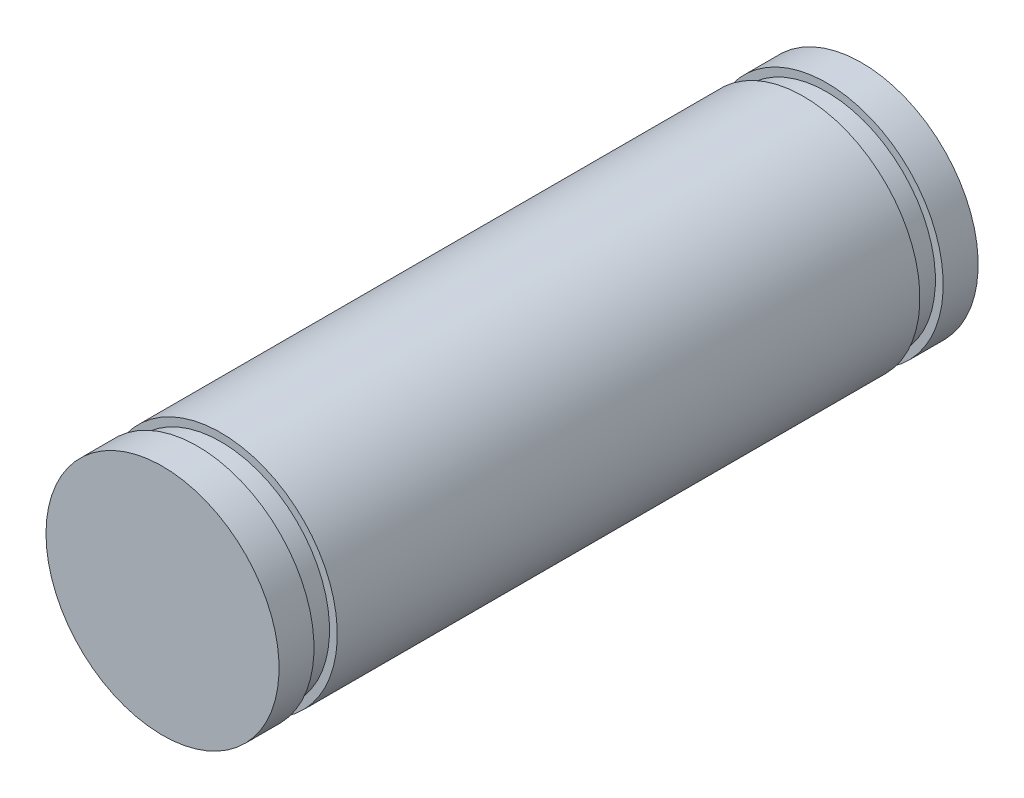
ISO-10303-21;
HEADER;
FILE_DESCRIPTION(('STEP AP214'),'2;1');
FILE_NAME('part.step','',(''),(''),'','','');
FILE_SCHEMA(('AUTOMOTIVE_DESIGN { 1 0 10303 214 1 1 1 1 }'));
ENDSEC;
DATA;
#1=APPLICATION_CONTEXT('core data for automotive mechanical design processes');
#2=APPLICATION_PROTOCOL_DEFINITION('international standard','automotive_design',2000,#1);
#3=PRODUCT_CONTEXT('',#1,'mechanical');
#4=PRODUCT('Part','Part','',(#3));
#5=PRODUCT_RELATED_PRODUCT_CATEGORY('part','',(#4));
#6=PRODUCT_DEFINITION_FORMATION('','',#4);
#7=PRODUCT_DEFINITION_CONTEXT('part definition',#1,'design');
#8=PRODUCT_DEFINITION('design','',#6,#7);
#9=PRODUCT_DEFINITION_SHAPE('','',#8);
#10=(LENGTH_UNIT() NAMED_UNIT(*) SI_UNIT(.MILLI.,.METRE.));
#11=(NAMED_UNIT(*) PLANE_ANGLE_UNIT() SI_UNIT($,.RADIAN.));
#12=(NAMED_UNIT(*) SI_UNIT($,.STERADIAN.) SOLID_ANGLE_UNIT());
#13=UNCERTAINTY_MEASURE_WITH_UNIT(LENGTH_MEASURE(1.E-05),#10,'distance_accuracy_value','');
#14=(GEOMETRIC_REPRESENTATION_CONTEXT(3) GLOBAL_UNCERTAINTY_ASSIGNED_CONTEXT((#13)) GLOBAL_UNIT_ASSIGNED_CONTEXT((#10,
#11,#12)) REPRESENTATION_CONTEXT('',''));
#15=CARTESIAN_POINT('',(0.,0.,0.));
#16=DIRECTION('',(0.,0.,1.));
#17=DIRECTION('',(1.,0.,0.));
#18=AXIS2_PLACEMENT_3D('',#15,#16,#17);
#19=CARTESIAN_POINT('',(0.,0.,18.));
#20=DIRECTION('',(0.,0.,1.));
#21=DIRECTION('',(1.,0.,0.));
#22=AXIS2_PLACEMENT_3D('',#19,#20,#21);
#23=PLANE('',#22);
#24=CARTESIAN_POINT('',(0.,0.,18.));
#25=DIRECTION('',(0.,0.,-1.));
#26=DIRECTION('',(-1.,0.,0.));
#27=AXIS2_PLACEMENT_3D('',#24,#25,#26);
#28=CIRCLE('',#27,3.);
#29=CARTESIAN_POINT('',(-3.,0.,18.));
#30=VERTEX_POINT('',#29);
#31=EDGE_CURVE('E18',#30,#30,#28,.T.);
#32=ORIENTED_EDGE('',*,*,#31,.F.);
#33=EDGE_LOOP('',(#32));
#34=FACE_BOUND('',#33,.T.);
#35=ADVANCED_FACE('F15',(#34),#23,.T.);
#36=CARTESIAN_POINT('',(0.,0.,0.));
#37=DIRECTION('',(0.,0.,1.));
#38=DIRECTION('',(1.,0.,0.));
#39=AXIS2_PLACEMENT_3D('',#36,#37,#38);
#40=PLANE('',#39);
#41=CARTESIAN_POINT('',(0.,0.,0.));
#42=DIRECTION('',(0.,0.,-1.));
#43=DIRECTION('',(-1.,0.,0.));
#44=AXIS2_PLACEMENT_3D('',#41,#42,#43);
#45=CIRCLE('',#44,3.);
#46=CARTESIAN_POINT('',(-3.,0.,0.));
#47=VERTEX_POINT('',#46);
#48=EDGE_CURVE('E46',#47,#47,#45,.F.);
#49=ORIENTED_EDGE('',*,*,#48,.F.);
#50=EDGE_LOOP('',(#49));
#51=FACE_BOUND('',#50,.T.);
#52=ADVANCED_FACE('F57',(#51),#40,.F.);
#53=CARTESIAN_POINT('',(0.,0.,18.));
#54=DIRECTION('',(0.,0.,-1.));
#55=DIRECTION('',(-1.,0.,0.));
#56=AXIS2_PLACEMENT_3D('',#53,#54,#55);
#57=CYLINDRICAL_SURFACE('',#56,3.);
#58=ORIENTED_EDGE('',*,*,#31,.T.);
#59=EDGE_LOOP('',(#58));
#60=FACE_BOUND('',#59,.T.);
#61=CARTESIAN_POINT('',(0.,0.,17.1));
#62=DIRECTION('',(0.,0.,-1.));
#63=DIRECTION('',(-1.,0.,0.));
#64=AXIS2_PLACEMENT_3D('',#61,#62,#63);
#65=CIRCLE('',#64,3.);
#66=CARTESIAN_POINT('',(-3.,0.,17.1));
#67=VERTEX_POINT('',#66);
#68=EDGE_CURVE('E44',#67,#67,#65,.T.);
#69=ORIENTED_EDGE('',*,*,#68,.F.);
#70=EDGE_LOOP('',(#69));
#71=FACE_BOUND('',#70,.T.);
#72=ADVANCED_FACE('F53',(#60,#71),#57,.T.);
#73=CARTESIAN_POINT('',(0.,0.,18.));
#74=DIRECTION('',(0.,0.,-1.));
#75=DIRECTION('',(-1.,0.,0.));
#76=AXIS2_PLACEMENT_3D('',#73,#74,#75);
#77=CYLINDRICAL_SURFACE('',#76,3.);
#78=CARTESIAN_POINT('',(0.,0.,0.900000000000001));
#79=DIRECTION('',(0.,0.,-1.));
#80=DIRECTION('',(-1.,0.,0.));
#81=AXIS2_PLACEMENT_3D('',#78,#79,#80);
#82=CIRCLE('',#81,3.);
#83=CARTESIAN_POINT('',(-3.,0.,0.900000000000001));
#84=VERTEX_POINT('',#83);
#85=EDGE_CURVE('E41',#84,#84,#82,.F.);
#86=ORIENTED_EDGE('',*,*,#85,.F.);
#87=EDGE_LOOP('',(#86));
#88=FACE_BOUND('',#87,.T.);
#89=ORIENTED_EDGE('',*,*,#48,.T.);
#90=EDGE_LOOP('',(#89));
#91=FACE_BOUND('',#90,.T.);
#92=ADVANCED_FACE('F93',(#88,#91),#77,.T.);
#93=CARTESIAN_POINT('',(3.,0.,17.1));
#94=DIRECTION('',(0.,0.,-1.));
#95=DIRECTION('',(-1.,0.,0.));
#96=AXIS2_PLACEMENT_3D('',#93,#94,#95);
#97=PLANE('',#96);
#98=CARTESIAN_POINT('',(0.,0.,17.1));
#99=DIRECTION('',(0.,0.,-1.));
#100=DIRECTION('',(-1.,0.,0.));
#101=AXIS2_PLACEMENT_3D('',#98,#99,#100);
#102=CIRCLE('',#101,2.8);
#103=CARTESIAN_POINT('',(-2.8,0.,17.1));
#104=VERTEX_POINT('',#103);
#105=EDGE_CURVE('E38',#104,#104,#102,.T.);
#106=ORIENTED_EDGE('',*,*,#105,.F.);
#107=EDGE_LOOP('',(#106));
#108=FACE_BOUND('',#107,.T.);
#109=ORIENTED_EDGE('',*,*,#68,.T.);
#110=EDGE_LOOP('',(#109));
#111=FACE_BOUND('',#110,.T.);
#112=ADVANCED_FACE('F89',(#108,#111),#97,.T.);
#113=CARTESIAN_POINT('',(3.,0.,0.9));
#114=DIRECTION('',(0.,0.,1.));
#115=DIRECTION('',(1.,0.,0.));
#116=AXIS2_PLACEMENT_3D('',#113,#114,#115);
#117=PLANE('',#116);
#118=ORIENTED_EDGE('',*,*,#85,.T.);
#119=EDGE_LOOP('',(#118));
#120=FACE_BOUND('',#119,.T.);
#121=CARTESIAN_POINT('',(0.,0.,0.9));
#122=DIRECTION('',(0.,0.,-1.));
#123=DIRECTION('',(-1.,0.,0.));
#124=AXIS2_PLACEMENT_3D('',#121,#122,#123);
#125=CIRCLE('',#124,2.8);
#126=CARTESIAN_POINT('',(-2.8,0.,0.9));
#127=VERTEX_POINT('',#126);
#128=EDGE_CURVE('E35',#127,#127,#125,.F.);
#129=ORIENTED_EDGE('',*,*,#128,.F.);
#130=EDGE_LOOP('',(#129));
#131=FACE_BOUND('',#130,.T.);
#132=ADVANCED_FACE('F85',(#120,#131),#117,.T.);
#133=CARTESIAN_POINT('',(0.,0.,0.));
#134=DIRECTION('',(0.,0.,-1.));
#135=DIRECTION('',(-1.,0.,0.));
#136=AXIS2_PLACEMENT_3D('',#133,#134,#135);
#137=CYLINDRICAL_SURFACE('',#136,2.8);
#138=ORIENTED_EDGE('',*,*,#105,.T.);
#139=EDGE_LOOP('',(#138));
#140=FACE_BOUND('',#139,.T.);
#141=CARTESIAN_POINT('',(0.,0.,16.5));
#142=DIRECTION('',(0.,0.,-1.));
#143=DIRECTION('',(-1.,0.,0.));
#144=AXIS2_PLACEMENT_3D('',#141,#142,#143);
#145=CIRCLE('',#144,2.8);
#146=CARTESIAN_POINT('',(-2.8,0.,16.5));
#147=VERTEX_POINT('',#146);
#148=EDGE_CURVE('E32',#147,#147,#145,.T.);
#149=ORIENTED_EDGE('',*,*,#148,.F.);
#150=EDGE_LOOP('',(#149));
#151=FACE_BOUND('',#150,.T.);
#152=ADVANCED_FACE('F81',(#140,#151),#137,.T.);
#153=CARTESIAN_POINT('',(0.,0.,0.));
#154=DIRECTION('',(0.,0.,-1.));
#155=DIRECTION('',(-1.,0.,0.));
#156=AXIS2_PLACEMENT_3D('',#153,#154,#155);
#157=CYLINDRICAL_SURFACE('',#156,2.8);
#158=CARTESIAN_POINT('',(0.,0.,1.5));
#159=DIRECTION('',(0.,0.,-1.));
#160=DIRECTION('',(-1.,0.,0.));
#161=AXIS2_PLACEMENT_3D('',#158,#159,#160);
#162=CIRCLE('',#161,2.8);
#163=CARTESIAN_POINT('',(-2.8,0.,1.5));
#164=VERTEX_POINT('',#163);
#165=EDGE_CURVE('E27',#164,#164,#162,.F.);
#166=ORIENTED_EDGE('',*,*,#165,.F.);
#167=EDGE_LOOP('',(#166));
#168=FACE_BOUND('',#167,.T.);
#169=ORIENTED_EDGE('',*,*,#128,.T.);
#170=EDGE_LOOP('',(#169));
#171=FACE_BOUND('',#170,.T.);
#172=ADVANCED_FACE('F77',(#168,#171),#157,.T.);
#173=CARTESIAN_POINT('',(3.,0.,16.5));
#174=DIRECTION('',(0.,0.,1.));
#175=DIRECTION('',(1.,0.,0.));
#176=AXIS2_PLACEMENT_3D('',#173,#174,#175);
#177=PLANE('',#176);
#178=CARTESIAN_POINT('',(0.,0.,16.5));
#179=DIRECTION('',(0.,0.,-1.));
#180=DIRECTION('',(-1.,0.,0.));
#181=AXIS2_PLACEMENT_3D('',#178,#179,#180);
#182=CIRCLE('',#181,3.);
#183=CARTESIAN_POINT('',(-3.,0.,16.5));
#184=VERTEX_POINT('',#183);
#185=EDGE_CURVE('E22',#184,#184,#182,.T.);
#186=ORIENTED_EDGE('',*,*,#185,.F.);
#187=EDGE_LOOP('',(#186));
#188=FACE_BOUND('',#187,.T.);
#189=ORIENTED_EDGE('',*,*,#148,.T.);
#190=EDGE_LOOP('',(#189));
#191=FACE_BOUND('',#190,.T.);
#192=ADVANCED_FACE('F70',(#188,#191),#177,.T.);
#193=CARTESIAN_POINT('',(3.,0.,1.5));
#194=DIRECTION('',(0.,0.,-1.));
#195=DIRECTION('',(-1.,0.,0.));
#196=AXIS2_PLACEMENT_3D('',#193,#194,#195);
#197=PLANE('',#196);
#198=ORIENTED_EDGE('',*,*,#165,.T.);
#199=EDGE_LOOP('',(#198));
#200=FACE_BOUND('',#199,.T.);
#201=CARTESIAN_POINT('',(0.,0.,1.5));
#202=DIRECTION('',(0.,0.,-1.));
#203=DIRECTION('',(-1.,0.,0.));
#204=AXIS2_PLACEMENT_3D('',#201,#202,#203);
#205=CIRCLE('',#204,3.);
#206=CARTESIAN_POINT('',(-3.,0.,1.5));
#207=VERTEX_POINT('',#206);
#208=EDGE_CURVE('E10',#207,#207,#205,.F.);
#209=ORIENTED_EDGE('',*,*,#208,.F.);
#210=EDGE_LOOP('',(#209));
#211=FACE_BOUND('',#210,.T.);
#212=ADVANCED_FACE('F65',(#200,#211),#197,.T.);
#213=CARTESIAN_POINT('',(0.,0.,18.));
#214=DIRECTION('',(0.,0.,-1.));
#215=DIRECTION('',(-1.,0.,0.));
#216=AXIS2_PLACEMENT_3D('',#213,#214,#215);
#217=CYLINDRICAL_SURFACE('',#216,3.);
#218=ORIENTED_EDGE('',*,*,#208,.T.);
#219=EDGE_LOOP('',(#218));
#220=FACE_BOUND('',#219,.T.);
#221=ORIENTED_EDGE('',*,*,#185,.T.);
#222=EDGE_LOOP('',(#221));
#223=FACE_BOUND('',#222,.T.);
#224=ADVANCED_FACE('F63',(#220,#223),#217,.T.);
#225=CLOSED_SHELL('',(#35,#52,#72,#92,#112,#132,#152,#172,#192,#212,#224));
#226=MANIFOLD_SOLID_BREP('B1',#225);
#227=ADVANCED_BREP_SHAPE_REPRESENTATION('',(#18,#226),#14);
#228=SHAPE_DEFINITION_REPRESENTATION(#9,#227);
ENDSEC;
END-ISO-10303-21;
